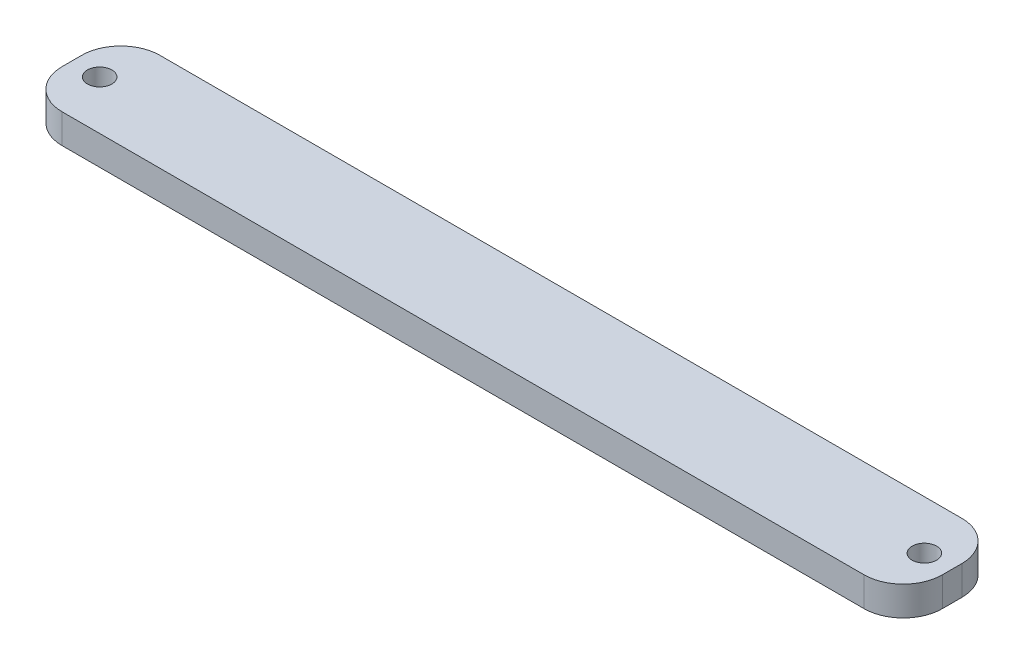
ISO-10303-21;
HEADER;
FILE_DESCRIPTION(('STEP AP214'),'2;1');
FILE_NAME('part.step','',(''),(''),'','','');
FILE_SCHEMA(('AUTOMOTIVE_DESIGN { 1 0 10303 214 1 1 1 1 }'));
ENDSEC;
DATA;
#1=APPLICATION_CONTEXT('core data for automotive mechanical design processes');
#2=APPLICATION_PROTOCOL_DEFINITION('international standard','automotive_design',2000,#1);
#3=PRODUCT_CONTEXT('',#1,'mechanical');
#4=PRODUCT('Part','Part','',(#3));
#5=PRODUCT_RELATED_PRODUCT_CATEGORY('part','',(#4));
#6=PRODUCT_DEFINITION_FORMATION('','',#4);
#7=PRODUCT_DEFINITION_CONTEXT('part definition',#1,'design');
#8=PRODUCT_DEFINITION('design','',#6,#7);
#9=PRODUCT_DEFINITION_SHAPE('','',#8);
#10=(LENGTH_UNIT() NAMED_UNIT(*) SI_UNIT(.MILLI.,.METRE.));
#11=(NAMED_UNIT(*) PLANE_ANGLE_UNIT() SI_UNIT($,.RADIAN.));
#12=(NAMED_UNIT(*) SI_UNIT($,.STERADIAN.) SOLID_ANGLE_UNIT());
#13=UNCERTAINTY_MEASURE_WITH_UNIT(LENGTH_MEASURE(1.E-05),#10,'distance_accuracy_value','');
#14=(GEOMETRIC_REPRESENTATION_CONTEXT(3) GLOBAL_UNCERTAINTY_ASSIGNED_CONTEXT((#13)) GLOBAL_UNIT_ASSIGNED_CONTEXT((#10,
#11,#12)) REPRESENTATION_CONTEXT('',''));
#15=CARTESIAN_POINT('',(0.,0.,0.));
#16=DIRECTION('',(0.,0.,1.));
#17=DIRECTION('',(1.,0.,0.));
#18=AXIS2_PLACEMENT_3D('',#15,#16,#17);
#19=CARTESIAN_POINT('',(-57.15,3.81,12.7));
#20=DIRECTION('',(0.,0.,-1.));
#21=DIRECTION('',(-1.,0.,0.));
#22=AXIS2_PLACEMENT_3D('',#19,#20,#21);
#23=PLANE('',#22);
#24=DIRECTION('',(1.,0.,0.));
#25=VECTOR('',#24,1.);
#26=CARTESIAN_POINT('',(-57.15,3.81,12.7));
#27=LINE('',#26,#25);
#28=CARTESIAN_POINT('',(-52.07,3.81,12.7));
#29=VERTEX_POINT('',#28);
#30=CARTESIAN_POINT('',(52.07,3.81,12.7));
#31=VERTEX_POINT('',#30);
#32=EDGE_CURVE('E135',#29,#31,#27,.T.);
#33=ORIENTED_EDGE('',*,*,#32,.F.);
#34=DIRECTION('',(0.,-1.,0.));
#35=VECTOR('',#34,1.);
#36=CARTESIAN_POINT('',(-52.07,0.,12.7));
#37=LINE('',#36,#35);
#38=CARTESIAN_POINT('',(-52.07,0.,12.7));
#39=VERTEX_POINT('',#38);
#40=EDGE_CURVE('E178',#29,#39,#37,.T.);
#41=ORIENTED_EDGE('',*,*,#40,.T.);
#42=DIRECTION('',(1.,0.,0.));
#43=VECTOR('',#42,1.);
#44=CARTESIAN_POINT('',(-57.15,0.,12.7));
#45=LINE('',#44,#43);
#46=CARTESIAN_POINT('',(52.07,0.,12.7));
#47=VERTEX_POINT('',#46);
#48=EDGE_CURVE('E117',#39,#47,#45,.T.);
#49=ORIENTED_EDGE('',*,*,#48,.T.);
#50=DIRECTION('',(0.,-1.,0.));
#51=VECTOR('',#50,1.);
#52=CARTESIAN_POINT('',(52.07,3.81,12.7));
#53=LINE('',#52,#51);
#54=EDGE_CURVE('E175',#47,#31,#53,.F.);
#55=ORIENTED_EDGE('',*,*,#54,.T.);
#56=EDGE_LOOP('',(#33,#41,#49,#55));
#57=FACE_BOUND('',#56,.T.);
#58=ADVANCED_FACE('F45',(#57),#23,.F.);
#59=CARTESIAN_POINT('',(57.15,3.81,0.));
#60=DIRECTION('',(1.,0.,0.));
#61=DIRECTION('',(0.,0.,-1.));
#62=AXIS2_PLACEMENT_3D('',#59,#60,#61);
#63=PLANE('',#62);
#64=DIRECTION('',(0.,0.,1.));
#65=VECTOR('',#64,1.);
#66=CARTESIAN_POINT('',(57.15,3.81,0.));
#67=LINE('',#66,#65);
#68=CARTESIAN_POINT('',(57.15,3.81,5.07999999999998));
#69=VERTEX_POINT('',#68);
#70=CARTESIAN_POINT('',(57.15,3.81,7.61999999999998));
#71=VERTEX_POINT('',#70);
#72=EDGE_CURVE('E185',#69,#71,#67,.T.);
#73=ORIENTED_EDGE('',*,*,#72,.T.);
#74=DIRECTION('',(0.,-1.,0.));
#75=VECTOR('',#74,1.);
#76=CARTESIAN_POINT('',(57.15,0.,7.61999999999998));
#77=LINE('',#76,#75);
#78=CARTESIAN_POINT('',(57.15,0.,7.61999999999998));
#79=VERTEX_POINT('',#78);
#80=EDGE_CURVE('E11',#71,#79,#77,.T.);
#81=ORIENTED_EDGE('',*,*,#80,.T.);
#82=DIRECTION('',(0.,0.,1.));
#83=VECTOR('',#82,1.);
#84=CARTESIAN_POINT('',(57.15,0.,0.));
#85=LINE('',#84,#83);
#86=CARTESIAN_POINT('',(57.15,0.,5.07999999999998));
#87=VERTEX_POINT('',#86);
#88=EDGE_CURVE('E198',#87,#79,#85,.T.);
#89=ORIENTED_EDGE('',*,*,#88,.F.);
#90=DIRECTION('',(0.,-1.,0.));
#91=VECTOR('',#90,1.);
#92=CARTESIAN_POINT('',(57.15,3.81,5.07999999999998));
#93=LINE('',#92,#91);
#94=EDGE_CURVE('E54',#87,#69,#93,.F.);
#95=ORIENTED_EDGE('',*,*,#94,.T.);
#96=EDGE_LOOP('',(#73,#81,#89,#95));
#97=FACE_BOUND('',#96,.T.);
#98=ADVANCED_FACE('F228',(#97),#63,.T.);
#99=CARTESIAN_POINT('',(-57.15,3.81,0.));
#100=DIRECTION('',(0.,0.,-1.));
#101=DIRECTION('',(-1.,0.,0.));
#102=AXIS2_PLACEMENT_3D('',#99,#100,#101);
#103=PLANE('',#102);
#104=DIRECTION('',(1.,0.,0.));
#105=VECTOR('',#104,1.);
#106=CARTESIAN_POINT('',(-57.15,0.,0.));
#107=LINE('',#106,#105);
#108=CARTESIAN_POINT('',(-52.07,0.,0.));
#109=VERTEX_POINT('',#108);
#110=CARTESIAN_POINT('',(52.07,0.,0.));
#111=VERTEX_POINT('',#110);
#112=EDGE_CURVE('E136',#109,#111,#107,.T.);
#113=ORIENTED_EDGE('',*,*,#112,.F.);
#114=DIRECTION('',(0.,-1.,0.));
#115=VECTOR('',#114,1.);
#116=CARTESIAN_POINT('',(-52.07,3.81,0.));
#117=LINE('',#116,#115);
#118=CARTESIAN_POINT('',(-52.07,3.81,0.));
#119=VERTEX_POINT('',#118);
#120=EDGE_CURVE('E162',#109,#119,#117,.F.);
#121=ORIENTED_EDGE('',*,*,#120,.T.);
#122=DIRECTION('',(1.,0.,0.));
#123=VECTOR('',#122,1.);
#124=CARTESIAN_POINT('',(-57.15,3.81,0.));
#125=LINE('',#124,#123);
#126=CARTESIAN_POINT('',(52.07,3.81,0.));
#127=VERTEX_POINT('',#126);
#128=EDGE_CURVE('E148',#119,#127,#125,.T.);
#129=ORIENTED_EDGE('',*,*,#128,.T.);
#130=DIRECTION('',(0.,-1.,0.));
#131=VECTOR('',#130,1.);
#132=CARTESIAN_POINT('',(52.07,3.81,0.));
#133=LINE('',#132,#131);
#134=EDGE_CURVE('E158',#127,#111,#133,.T.);
#135=ORIENTED_EDGE('',*,*,#134,.T.);
#136=EDGE_LOOP('',(#113,#121,#129,#135));
#137=FACE_BOUND('',#136,.T.);
#138=ADVANCED_FACE('F207',(#137),#103,.T.);
#139=CARTESIAN_POINT('',(-57.15,3.81,12.7));
#140=DIRECTION('',(-1.,0.,0.));
#141=DIRECTION('',(0.,0.,1.));
#142=AXIS2_PLACEMENT_3D('',#139,#140,#141);
#143=PLANE('',#142);
#144=DIRECTION('',(0.,0.,-1.));
#145=VECTOR('',#144,1.);
#146=CARTESIAN_POINT('',(-57.15,3.81,12.7));
#147=LINE('',#146,#145);
#148=CARTESIAN_POINT('',(-57.15,3.81,7.62));
#149=VERTEX_POINT('',#148);
#150=CARTESIAN_POINT('',(-57.15,3.81,5.08));
#151=VERTEX_POINT('',#150);
#152=EDGE_CURVE('E142',#149,#151,#147,.T.);
#153=ORIENTED_EDGE('',*,*,#152,.T.);
#154=DIRECTION('',(0.,-1.,0.));
#155=VECTOR('',#154,1.);
#156=CARTESIAN_POINT('',(-57.15,3.81,5.08));
#157=LINE('',#156,#155);
#158=CARTESIAN_POINT('',(-57.15,0.,5.08));
#159=VERTEX_POINT('',#158);
#160=EDGE_CURVE('E133',#151,#159,#157,.T.);
#161=ORIENTED_EDGE('',*,*,#160,.T.);
#162=DIRECTION('',(0.,0.,-1.));
#163=VECTOR('',#162,1.);
#164=CARTESIAN_POINT('',(-57.15,0.,12.7));
#165=LINE('',#164,#163);
#166=CARTESIAN_POINT('',(-57.15,0.,7.62));
#167=VERTEX_POINT('',#166);
#168=EDGE_CURVE('E115',#167,#159,#165,.T.);
#169=ORIENTED_EDGE('',*,*,#168,.F.);
#170=DIRECTION('',(0.,-1.,0.));
#171=VECTOR('',#170,1.);
#172=CARTESIAN_POINT('',(-57.15,3.81,7.62));
#173=LINE('',#172,#171);
#174=EDGE_CURVE('E130',#167,#149,#173,.F.);
#175=ORIENTED_EDGE('',*,*,#174,.T.);
#176=EDGE_LOOP('',(#153,#161,#169,#175));
#177=FACE_BOUND('',#176,.T.);
#178=ADVANCED_FACE('F129',(#177),#143,.T.);
#179=CARTESIAN_POINT('',(0.,3.81,0.));
#180=DIRECTION('',(0.,-1.,0.));
#181=DIRECTION('',(-1.,0.,0.));
#182=AXIS2_PLACEMENT_3D('',#179,#180,#181);
#183=PLANE('',#182);
#184=CARTESIAN_POINT('',(-53.5468527503275,3.81,6.34999999999998));
#185=DIRECTION('',(0.,-1.,0.));
#186=DIRECTION('',(0.,0.,1.));
#187=AXIS2_PLACEMENT_3D('',#184,#185,#186);
#188=CIRCLE('',#187,1.5875);
#189=CARTESIAN_POINT('',(-53.5468527503275,3.81,7.93749999999998));
#190=VERTEX_POINT('',#189);
#191=EDGE_CURVE('E322',#190,#190,#188,.T.);
#192=ORIENTED_EDGE('',*,*,#191,.T.);
#193=EDGE_LOOP('',(#192));
#194=FACE_BOUND('',#193,.T.);
#195=CARTESIAN_POINT('',(53.5468527503275,3.81,6.34999999999998));
#196=DIRECTION('',(0.,1.,0.));
#197=DIRECTION('',(0.,0.,1.));
#198=AXIS2_PLACEMENT_3D('',#195,#196,#197);
#199=CIRCLE('',#198,1.5875);
#200=CARTESIAN_POINT('',(53.5468527503275,3.81,7.93749999999998));
#201=VERTEX_POINT('',#200);
#202=EDGE_CURVE('E190',#201,#201,#199,.T.);
#203=ORIENTED_EDGE('',*,*,#202,.F.);
#204=EDGE_LOOP('',(#203));
#205=FACE_BOUND('',#204,.T.);
#206=ORIENTED_EDGE('',*,*,#128,.F.);
#207=CARTESIAN_POINT('',(-52.07,3.81,5.08));
#208=DIRECTION('',(0.,-1.,0.));
#209=DIRECTION('',(0.,0.,-1.));
#210=AXIS2_PLACEMENT_3D('',#207,#208,#209);
#211=CIRCLE('',#210,5.08);
#212=EDGE_CURVE('E172',#119,#151,#211,.F.);
#213=ORIENTED_EDGE('',*,*,#212,.T.);
#214=ORIENTED_EDGE('',*,*,#152,.F.);
#215=CARTESIAN_POINT('',(-52.07,3.81,7.62));
#216=DIRECTION('',(0.,-1.,0.));
#217=DIRECTION('',(0.,0.,-1.));
#218=AXIS2_PLACEMENT_3D('',#215,#216,#217);
#219=CIRCLE('',#218,5.08);
#220=EDGE_CURVE('E140',#149,#29,#219,.F.);
#221=ORIENTED_EDGE('',*,*,#220,.T.);
#222=ORIENTED_EDGE('',*,*,#32,.T.);
#223=CARTESIAN_POINT('',(52.07,3.81,7.61999999999998));
#224=DIRECTION('',(0.,-1.,0.));
#225=DIRECTION('',(0.,0.,-1.));
#226=AXIS2_PLACEMENT_3D('',#223,#224,#225);
#227=CIRCLE('',#226,5.08);
#228=EDGE_CURVE('E61',#31,#71,#227,.F.);
#229=ORIENTED_EDGE('',*,*,#228,.T.);
#230=ORIENTED_EDGE('',*,*,#72,.F.);
#231=CARTESIAN_POINT('',(52.07,3.81,5.07999999999998));
#232=DIRECTION('',(0.,-1.,0.));
#233=DIRECTION('',(0.,0.,-1.));
#234=AXIS2_PLACEMENT_3D('',#231,#232,#233);
#235=CIRCLE('',#234,5.08);
#236=EDGE_CURVE('E165',#69,#127,#235,.F.);
#237=ORIENTED_EDGE('',*,*,#236,.T.);
#238=EDGE_LOOP('',(#206,#213,#214,#221,#222,#229,#230,#237));
#239=FACE_BOUND('',#238,.T.);
#240=ADVANCED_FACE('F213',(#194,#205,#239),#183,.F.);
#241=CARTESIAN_POINT('',(0.,0.,0.));
#242=DIRECTION('',(0.,-1.,0.));
#243=DIRECTION('',(-1.,0.,0.));
#244=AXIS2_PLACEMENT_3D('',#241,#242,#243);
#245=PLANE('',#244);
#246=CARTESIAN_POINT('',(-53.5468527503275,0.,6.34999999999998));
#247=DIRECTION('',(0.,-1.,0.));
#248=DIRECTION('',(0.,0.,1.));
#249=AXIS2_PLACEMENT_3D('',#246,#247,#248);
#250=CIRCLE('',#249,1.5875);
#251=CARTESIAN_POINT('',(-53.5468527503275,0.,7.93749999999998));
#252=VERTEX_POINT('',#251);
#253=EDGE_CURVE('E327',#252,#252,#250,.T.);
#254=ORIENTED_EDGE('',*,*,#253,.F.);
#255=EDGE_LOOP('',(#254));
#256=FACE_BOUND('',#255,.T.);
#257=CARTESIAN_POINT('',(53.5468527503275,0.,6.34999999999998));
#258=DIRECTION('',(0.,1.,0.));
#259=DIRECTION('',(0.,0.,1.));
#260=AXIS2_PLACEMENT_3D('',#257,#258,#259);
#261=CIRCLE('',#260,1.5875);
#262=CARTESIAN_POINT('',(53.5468527503275,0.,7.93749999999998));
#263=VERTEX_POINT('',#262);
#264=EDGE_CURVE('E199',#263,#263,#261,.T.);
#265=ORIENTED_EDGE('',*,*,#264,.T.);
#266=EDGE_LOOP('',(#265));
#267=FACE_BOUND('',#266,.T.);
#268=ORIENTED_EDGE('',*,*,#168,.T.);
#269=CARTESIAN_POINT('',(-52.07,0.,5.08));
#270=DIRECTION('',(0.,-1.,0.));
#271=DIRECTION('',(0.,0.,-1.));
#272=AXIS2_PLACEMENT_3D('',#269,#270,#271);
#273=CIRCLE('',#272,5.08);
#274=EDGE_CURVE('E123',#159,#109,#273,.T.);
#275=ORIENTED_EDGE('',*,*,#274,.T.);
#276=ORIENTED_EDGE('',*,*,#112,.T.);
#277=CARTESIAN_POINT('',(52.07,0.,5.07999999999998));
#278=DIRECTION('',(0.,-1.,0.));
#279=DIRECTION('',(0.,0.,-1.));
#280=AXIS2_PLACEMENT_3D('',#277,#278,#279);
#281=CIRCLE('',#280,5.08);
#282=EDGE_CURVE('E146',#111,#87,#281,.T.);
#283=ORIENTED_EDGE('',*,*,#282,.T.);
#284=ORIENTED_EDGE('',*,*,#88,.T.);
#285=CARTESIAN_POINT('',(52.07,0.,7.61999999999998));
#286=DIRECTION('',(0.,-1.,0.));
#287=DIRECTION('',(0.,0.,-1.));
#288=AXIS2_PLACEMENT_3D('',#285,#286,#287);
#289=CIRCLE('',#288,5.08);
#290=EDGE_CURVE('E124',#79,#47,#289,.T.);
#291=ORIENTED_EDGE('',*,*,#290,.T.);
#292=ORIENTED_EDGE('',*,*,#48,.F.);
#293=CARTESIAN_POINT('',(-52.07,0.,7.62));
#294=DIRECTION('',(0.,-1.,0.));
#295=DIRECTION('',(0.,0.,-1.));
#296=AXIS2_PLACEMENT_3D('',#293,#294,#295);
#297=CIRCLE('',#296,5.08);
#298=EDGE_CURVE('E112',#39,#167,#297,.T.);
#299=ORIENTED_EDGE('',*,*,#298,.T.);
#300=EDGE_LOOP('',(#268,#275,#276,#283,#284,#291,#292,#299));
#301=FACE_BOUND('',#300,.T.);
#302=ADVANCED_FACE('F114',(#256,#267,#301),#245,.T.);
#303=CARTESIAN_POINT('',(-52.07,3.81,5.08));
#304=DIRECTION('',(0.,-1.,0.));
#305=DIRECTION('',(0.,0.,-1.));
#306=AXIS2_PLACEMENT_3D('',#303,#304,#305);
#307=CYLINDRICAL_SURFACE('',#306,5.08);
#308=ORIENTED_EDGE('',*,*,#212,.F.);
#309=ORIENTED_EDGE('',*,*,#120,.F.);
#310=ORIENTED_EDGE('',*,*,#274,.F.);
#311=ORIENTED_EDGE('',*,*,#160,.F.);
#312=EDGE_LOOP('',(#308,#309,#310,#311));
#313=FACE_BOUND('',#312,.T.);
#314=ADVANCED_FACE('F212',(#313),#307,.T.);
#315=CARTESIAN_POINT('',(-52.07,3.81,7.62));
#316=DIRECTION('',(0.,1.,0.));
#317=DIRECTION('',(0.,0.,1.));
#318=AXIS2_PLACEMENT_3D('',#315,#316,#317);
#319=CYLINDRICAL_SURFACE('',#318,5.08);
#320=ORIENTED_EDGE('',*,*,#220,.F.);
#321=ORIENTED_EDGE('',*,*,#174,.F.);
#322=ORIENTED_EDGE('',*,*,#298,.F.);
#323=ORIENTED_EDGE('',*,*,#40,.F.);
#324=EDGE_LOOP('',(#320,#321,#322,#323));
#325=FACE_BOUND('',#324,.T.);
#326=ADVANCED_FACE('F139',(#325),#319,.T.);
#327=CARTESIAN_POINT('',(52.07,3.81,7.61999999999998));
#328=DIRECTION('',(0.,1.,0.));
#329=DIRECTION('',(0.,0.,1.));
#330=AXIS2_PLACEMENT_3D('',#327,#328,#329);
#331=CYLINDRICAL_SURFACE('',#330,5.08);
#332=ORIENTED_EDGE('',*,*,#228,.F.);
#333=ORIENTED_EDGE('',*,*,#54,.F.);
#334=ORIENTED_EDGE('',*,*,#290,.F.);
#335=ORIENTED_EDGE('',*,*,#80,.F.);
#336=EDGE_LOOP('',(#332,#333,#334,#335));
#337=FACE_BOUND('',#336,.T.);
#338=ADVANCED_FACE('F218',(#337),#331,.T.);
#339=CARTESIAN_POINT('',(52.07,3.81,5.07999999999998));
#340=DIRECTION('',(0.,-1.,0.));
#341=DIRECTION('',(0.,0.,-1.));
#342=AXIS2_PLACEMENT_3D('',#339,#340,#341);
#343=CYLINDRICAL_SURFACE('',#342,5.08);
#344=ORIENTED_EDGE('',*,*,#236,.F.);
#345=ORIENTED_EDGE('',*,*,#94,.F.);
#346=ORIENTED_EDGE('',*,*,#282,.F.);
#347=ORIENTED_EDGE('',*,*,#134,.F.);
#348=EDGE_LOOP('',(#344,#345,#346,#347));
#349=FACE_BOUND('',#348,.T.);
#350=ADVANCED_FACE('F47',(#349),#343,.T.);
#351=CARTESIAN_POINT('',(53.5468527503275,0.,6.34999999999998));
#352=DIRECTION('',(0.,1.,0.));
#353=DIRECTION('',(0.,0.,1.));
#354=AXIS2_PLACEMENT_3D('',#351,#352,#353);
#355=CYLINDRICAL_SURFACE('',#354,1.5875);
#356=ORIENTED_EDGE('',*,*,#264,.F.);
#357=EDGE_LOOP('',(#356));
#358=FACE_BOUND('',#357,.T.);
#359=ORIENTED_EDGE('',*,*,#202,.T.);
#360=EDGE_LOOP('',(#359));
#361=FACE_BOUND('',#360,.T.);
#362=ADVANCED_FACE('F217',(#358,#361),#355,.F.);
#363=CARTESIAN_POINT('',(-53.5468527503275,0.,6.34999999999998));
#364=DIRECTION('',(0.,1.,0.));
#365=DIRECTION('',(0.,0.,1.));
#366=AXIS2_PLACEMENT_3D('',#363,#364,#365);
#367=CYLINDRICAL_SURFACE('',#366,1.5875);
#368=ORIENTED_EDGE('',*,*,#253,.T.);
#369=EDGE_LOOP('',(#368));
#370=FACE_BOUND('',#369,.T.);
#371=ORIENTED_EDGE('',*,*,#191,.F.);
#372=EDGE_LOOP('',(#371));
#373=FACE_BOUND('',#372,.T.);
#374=ADVANCED_FACE('F223',(#370,#373),#367,.F.);
#375=CLOSED_SHELL('',(#58,#98,#138,#178,#240,#302,#314,#326,#338,#350,#362,#374));
#376=MANIFOLD_SOLID_BREP('B2',#375);
#377=ADVANCED_BREP_SHAPE_REPRESENTATION('',(#18,#376),#14);
#378=SHAPE_DEFINITION_REPRESENTATION(#9,#377);
ENDSEC;
END-ISO-10303-21;
